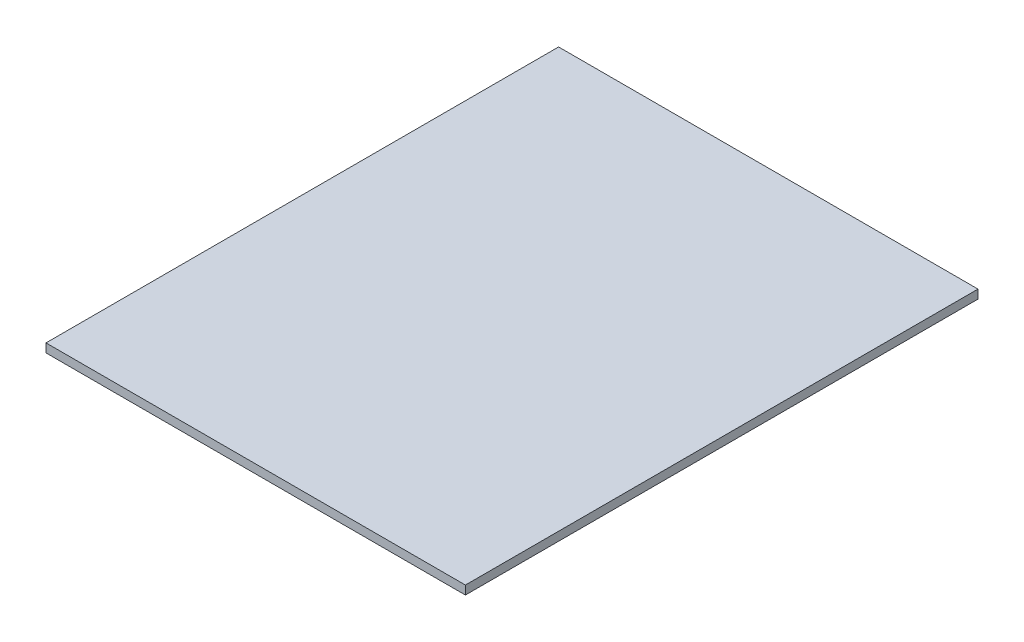
ISO-10303-21;
HEADER;
FILE_DESCRIPTION(('STEP AP214'),'2;1');
FILE_NAME('part.step','',(''),(''),'','','');
FILE_SCHEMA(('AUTOMOTIVE_DESIGN { 1 0 10303 214 1 1 1 1 }'));
ENDSEC;
DATA;
#1=APPLICATION_CONTEXT('core data for automotive mechanical design processes');
#2=APPLICATION_PROTOCOL_DEFINITION('international standard','automotive_design',2000,#1);
#3=PRODUCT_CONTEXT('',#1,'mechanical');
#4=PRODUCT('Part','Part','',(#3));
#5=PRODUCT_RELATED_PRODUCT_CATEGORY('part','',(#4));
#6=PRODUCT_DEFINITION_FORMATION('','',#4);
#7=PRODUCT_DEFINITION_CONTEXT('part definition',#1,'design');
#8=PRODUCT_DEFINITION('design','',#6,#7);
#9=PRODUCT_DEFINITION_SHAPE('','',#8);
#10=(LENGTH_UNIT() NAMED_UNIT(*) SI_UNIT(.MILLI.,.METRE.));
#11=(NAMED_UNIT(*) PLANE_ANGLE_UNIT() SI_UNIT($,.RADIAN.));
#12=(NAMED_UNIT(*) SI_UNIT($,.STERADIAN.) SOLID_ANGLE_UNIT());
#13=UNCERTAINTY_MEASURE_WITH_UNIT(LENGTH_MEASURE(1.E-05),#10,'distance_accuracy_value','');
#14=(GEOMETRIC_REPRESENTATION_CONTEXT(3) GLOBAL_UNCERTAINTY_ASSIGNED_CONTEXT((#13)) GLOBAL_UNIT_ASSIGNED_CONTEXT((#10,
#11,#12)) REPRESENTATION_CONTEXT('',''));
#15=CARTESIAN_POINT('',(0.,0.,0.));
#16=DIRECTION('',(0.,0.,1.));
#17=DIRECTION('',(1.,0.,0.));
#18=AXIS2_PLACEMENT_3D('',#15,#16,#17);
#19=CARTESIAN_POINT('',(-67.5,2.8,82.5));
#20=DIRECTION('',(-1.,0.,0.));
#21=DIRECTION('',(0.,0.,1.));
#22=AXIS2_PLACEMENT_3D('',#19,#20,#21);
#23=PLANE('',#22);
#24=DIRECTION('',(0.,0.,-1.));
#25=VECTOR('',#24,1.);
#26=CARTESIAN_POINT('',(-67.5,0.,82.5));
#27=LINE('',#26,#25);
#28=CARTESIAN_POINT('',(-67.5,0.,82.5));
#29=VERTEX_POINT('',#28);
#30=CARTESIAN_POINT('',(-67.5,0.,-82.5));
#31=VERTEX_POINT('',#30);
#32=EDGE_CURVE('E99',#29,#31,#27,.T.);
#33=ORIENTED_EDGE('',*,*,#32,.F.);
#34=DIRECTION('',(0.,-1.,0.));
#35=VECTOR('',#34,1.);
#36=CARTESIAN_POINT('',(-67.5,2.8,82.5));
#37=LINE('',#36,#35);
#38=CARTESIAN_POINT('',(-67.5,2.8,82.5));
#39=VERTEX_POINT('',#38);
#40=EDGE_CURVE('E11',#39,#29,#37,.T.);
#41=ORIENTED_EDGE('',*,*,#40,.F.);
#42=DIRECTION('',(0.,0.,-1.));
#43=VECTOR('',#42,1.);
#44=CARTESIAN_POINT('',(-67.5,2.8,82.5));
#45=LINE('',#44,#43);
#46=CARTESIAN_POINT('',(-67.5,2.8,-82.5));
#47=VERTEX_POINT('',#46);
#48=EDGE_CURVE('E94',#39,#47,#45,.T.);
#49=ORIENTED_EDGE('',*,*,#48,.T.);
#50=DIRECTION('',(0.,-1.,0.));
#51=VECTOR('',#50,1.);
#52=CARTESIAN_POINT('',(-67.5,2.8,-82.5));
#53=LINE('',#52,#51);
#54=EDGE_CURVE('E37',#47,#31,#53,.T.);
#55=ORIENTED_EDGE('',*,*,#54,.T.);
#56=EDGE_LOOP('',(#33,#41,#49,#55));
#57=FACE_BOUND('',#56,.T.);
#58=ADVANCED_FACE('F34',(#57),#23,.T.);
#59=CARTESIAN_POINT('',(-67.5,2.8,82.5));
#60=DIRECTION('',(0.,0.,-1.));
#61=DIRECTION('',(-1.,0.,0.));
#62=AXIS2_PLACEMENT_3D('',#59,#60,#61);
#63=PLANE('',#62);
#64=DIRECTION('',(1.,0.,0.));
#65=VECTOR('',#64,1.);
#66=CARTESIAN_POINT('',(-67.5,0.,82.5));
#67=LINE('',#66,#65);
#68=CARTESIAN_POINT('',(67.5,0.,82.5));
#69=VERTEX_POINT('',#68);
#70=EDGE_CURVE('E67',#29,#69,#67,.T.);
#71=ORIENTED_EDGE('',*,*,#70,.T.);
#72=DIRECTION('',(0.,-1.,0.));
#73=VECTOR('',#72,1.);
#74=CARTESIAN_POINT('',(67.5,2.8,82.5));
#75=LINE('',#74,#73);
#76=CARTESIAN_POINT('',(67.5,2.8,82.5));
#77=VERTEX_POINT('',#76);
#78=EDGE_CURVE('E43',#77,#69,#75,.T.);
#79=ORIENTED_EDGE('',*,*,#78,.F.);
#80=DIRECTION('',(1.,0.,0.));
#81=VECTOR('',#80,1.);
#82=CARTESIAN_POINT('',(-67.5,2.8,82.5));
#83=LINE('',#82,#81);
#84=EDGE_CURVE('E84',#39,#77,#83,.T.);
#85=ORIENTED_EDGE('',*,*,#84,.F.);
#86=ORIENTED_EDGE('',*,*,#40,.T.);
#87=EDGE_LOOP('',(#71,#79,#85,#86));
#88=FACE_BOUND('',#87,.T.);
#89=ADVANCED_FACE('F109',(#88),#63,.F.);
#90=CARTESIAN_POINT('',(67.5,2.8,82.5));
#91=DIRECTION('',(-1.,0.,0.));
#92=DIRECTION('',(0.,0.,1.));
#93=AXIS2_PLACEMENT_3D('',#90,#91,#92);
#94=PLANE('',#93);
#95=DIRECTION('',(0.,0.,-1.));
#96=VECTOR('',#95,1.);
#97=CARTESIAN_POINT('',(67.5,0.,82.5));
#98=LINE('',#97,#96);
#99=CARTESIAN_POINT('',(67.5,0.,-82.5));
#100=VERTEX_POINT('',#99);
#101=EDGE_CURVE('E91',#69,#100,#98,.T.);
#102=ORIENTED_EDGE('',*,*,#101,.T.);
#103=DIRECTION('',(0.,-1.,0.));
#104=VECTOR('',#103,1.);
#105=CARTESIAN_POINT('',(67.5,2.8,-82.5));
#106=LINE('',#105,#104);
#107=CARTESIAN_POINT('',(67.5,2.8,-82.5));
#108=VERTEX_POINT('',#107);
#109=EDGE_CURVE('E88',#108,#100,#106,.T.);
#110=ORIENTED_EDGE('',*,*,#109,.F.);
#111=DIRECTION('',(0.,0.,-1.));
#112=VECTOR('',#111,1.);
#113=CARTESIAN_POINT('',(67.5,2.8,82.5));
#114=LINE('',#113,#112);
#115=EDGE_CURVE('E79',#77,#108,#114,.T.);
#116=ORIENTED_EDGE('',*,*,#115,.F.);
#117=ORIENTED_EDGE('',*,*,#78,.T.);
#118=EDGE_LOOP('',(#102,#110,#116,#117));
#119=FACE_BOUND('',#118,.T.);
#120=ADVANCED_FACE('F89',(#119),#94,.F.);
#121=CARTESIAN_POINT('',(-67.5,2.8,-82.5));
#122=DIRECTION('',(0.,0.,-1.));
#123=DIRECTION('',(-1.,0.,0.));
#124=AXIS2_PLACEMENT_3D('',#121,#122,#123);
#125=PLANE('',#124);
#126=DIRECTION('',(1.,0.,0.));
#127=VECTOR('',#126,1.);
#128=CARTESIAN_POINT('',(-67.5,0.,-82.5));
#129=LINE('',#128,#127);
#130=EDGE_CURVE('E102',#31,#100,#129,.T.);
#131=ORIENTED_EDGE('',*,*,#130,.F.);
#132=ORIENTED_EDGE('',*,*,#54,.F.);
#133=DIRECTION('',(1.,0.,0.));
#134=VECTOR('',#133,1.);
#135=CARTESIAN_POINT('',(-67.5,2.8,-82.5));
#136=LINE('',#135,#134);
#137=EDGE_CURVE('E83',#47,#108,#136,.T.);
#138=ORIENTED_EDGE('',*,*,#137,.T.);
#139=ORIENTED_EDGE('',*,*,#109,.T.);
#140=EDGE_LOOP('',(#131,#132,#138,#139));
#141=FACE_BOUND('',#140,.T.);
#142=ADVANCED_FACE('F93',(#141),#125,.T.);
#143=CARTESIAN_POINT('',(0.,2.8,0.));
#144=DIRECTION('',(0.,-1.,0.));
#145=DIRECTION('',(0.,0.,-1.));
#146=AXIS2_PLACEMENT_3D('',#143,#144,#145);
#147=PLANE('',#146);
#148=ORIENTED_EDGE('',*,*,#48,.F.);
#149=ORIENTED_EDGE('',*,*,#84,.T.);
#150=ORIENTED_EDGE('',*,*,#115,.T.);
#151=ORIENTED_EDGE('',*,*,#137,.F.);
#152=EDGE_LOOP('',(#148,#149,#150,#151));
#153=FACE_BOUND('',#152,.T.);
#154=ADVANCED_FACE('F82',(#153),#147,.F.);
#155=CARTESIAN_POINT('',(0.,0.,0.));
#156=DIRECTION('',(0.,-1.,0.));
#157=DIRECTION('',(0.,0.,-1.));
#158=AXIS2_PLACEMENT_3D('',#155,#156,#157);
#159=PLANE('',#158);
#160=ORIENTED_EDGE('',*,*,#32,.T.);
#161=ORIENTED_EDGE('',*,*,#130,.T.);
#162=ORIENTED_EDGE('',*,*,#101,.F.);
#163=ORIENTED_EDGE('',*,*,#70,.F.);
#164=EDGE_LOOP('',(#160,#161,#162,#163));
#165=FACE_BOUND('',#164,.T.);
#166=ADVANCED_FACE('F107',(#165),#159,.T.);
#167=CLOSED_SHELL('',(#58,#89,#120,#142,#154,#166));
#168=MANIFOLD_SOLID_BREP('B2',#167);
#169=ADVANCED_BREP_SHAPE_REPRESENTATION('',(#18,#168),#14);
#170=SHAPE_DEFINITION_REPRESENTATION(#9,#169);
ENDSEC;
END-ISO-10303-21;
